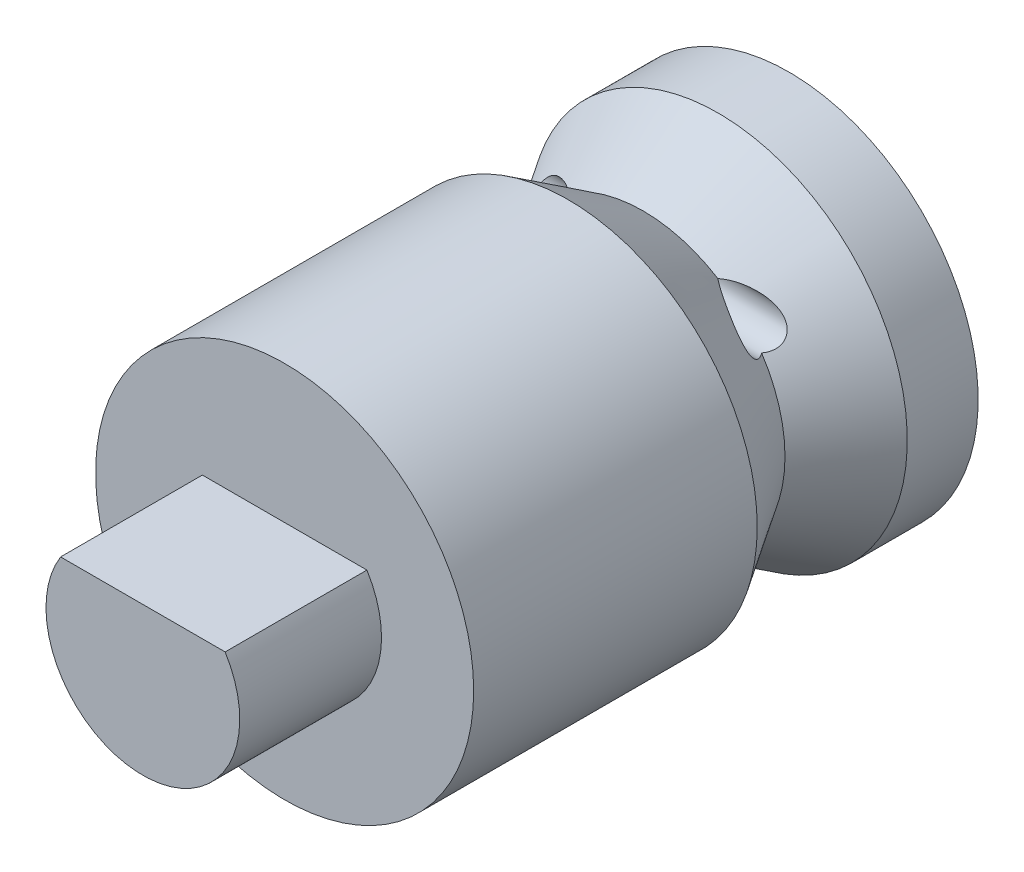
ISO-10303-21;
HEADER;
FILE_DESCRIPTION(('STEP AP214'),'2;1');
FILE_NAME('part.step','',(''),(''),'','','');
FILE_SCHEMA(('AUTOMOTIVE_DESIGN { 1 0 10303 214 1 1 1 1 }'));
ENDSEC;
DATA;
#1=APPLICATION_CONTEXT('core data for automotive mechanical design processes');
#2=APPLICATION_PROTOCOL_DEFINITION('international standard','automotive_design',2000,#1);
#3=PRODUCT_CONTEXT('',#1,'mechanical');
#4=PRODUCT('Part','Part','',(#3));
#5=PRODUCT_RELATED_PRODUCT_CATEGORY('part','',(#4));
#6=PRODUCT_DEFINITION_FORMATION('','',#4);
#7=PRODUCT_DEFINITION_CONTEXT('part definition',#1,'design');
#8=PRODUCT_DEFINITION('design','',#6,#7);
#9=PRODUCT_DEFINITION_SHAPE('','',#8);
#10=(LENGTH_UNIT() NAMED_UNIT(*) SI_UNIT(.MILLI.,.METRE.));
#11=(NAMED_UNIT(*) PLANE_ANGLE_UNIT() SI_UNIT($,.RADIAN.));
#12=(NAMED_UNIT(*) SI_UNIT($,.STERADIAN.) SOLID_ANGLE_UNIT());
#13=UNCERTAINTY_MEASURE_WITH_UNIT(LENGTH_MEASURE(1.E-05),#10,'distance_accuracy_value','');
#14=(GEOMETRIC_REPRESENTATION_CONTEXT(3) GLOBAL_UNCERTAINTY_ASSIGNED_CONTEXT((#13)) GLOBAL_UNIT_ASSIGNED_CONTEXT((#10,
#11,#12)) REPRESENTATION_CONTEXT('',''));
#15=CARTESIAN_POINT('',(0.,0.,0.));
#16=DIRECTION('',(0.,0.,1.));
#17=DIRECTION('',(1.,0.,0.));
#18=AXIS2_PLACEMENT_3D('',#15,#16,#17);
#19=CARTESIAN_POINT('',(0.,0.,3.175));
#20=DIRECTION('',(0.,0.,1.));
#21=DIRECTION('',(1.,0.,0.));
#22=AXIS2_PLACEMENT_3D('',#19,#20,#21);
#23=CONICAL_SURFACE('',#22,4.,0.562130374114294);
#24=CARTESIAN_POINT('',(1.5294042731664,2.5477242008201,1.5423));
#25=CARTESIAN_POINT('',(1.5482327028628,2.54948389636122,1.56007104937971));
#26=CARTESIAN_POINT('',(1.56774260902939,2.55017404496586,1.5771445647045));
#27=CARTESIAN_POINT('',(1.6076717351285,2.54974300659172,1.61007269180868));
#28=CARTESIAN_POINT('',(1.62808848113938,2.54862648473213,1.62593033250121));
#29=CARTESIAN_POINT('',(1.66948462537356,2.54491504151267,1.65669652034396));
#30=CARTESIAN_POINT('',(1.69046417839127,2.54231970936469,1.67160480249886));
#31=CARTESIAN_POINT('',(1.73280469353861,2.53580803655754,1.700604889451));
#32=CARTESIAN_POINT('',(1.7541659935145,2.53189046467972,1.71469591887069));
#33=CARTESIAN_POINT('',(1.81036423147723,2.52005173155219,1.7506050678101));
#34=CARTESIAN_POINT('',(1.84538065381172,2.5111519239564,1.77182427328294));
#35=CARTESIAN_POINT('',(1.91558198795479,2.49039681362099,1.81246733728234));
#36=CARTESIAN_POINT('',(1.95076694535503,2.47854066101174,1.8318906773411));
#37=CARTESIAN_POINT('',(2.02105545291796,2.45187922425174,1.8689294369262));
#38=CARTESIAN_POINT('',(2.05615878708333,2.4370693170562,1.88654195593412));
#39=CARTESIAN_POINT('',(2.12590526372888,2.40443040151884,1.91970927100217));
#40=CARTESIAN_POINT('',(2.16054871285227,2.3866035264529,1.93526550729696));
#41=CARTESIAN_POINT('',(2.23226917336937,2.34590377859288,1.96529725300637));
#42=CARTESIAN_POINT('',(2.26926898382374,2.32271416418155,1.97953387014772));
#43=CARTESIAN_POINT('',(2.34159831263125,2.27215599528751,2.00421674554654));
#44=CARTESIAN_POINT('',(2.37693153027699,2.24479732761817,2.01467177888853));
#45=CARTESIAN_POINT('',(2.43568145913419,2.19349724754097,2.02824807823447));
#46=CARTESIAN_POINT('',(2.45974184218238,2.17062443959667,2.03258681514409));
#47=CARTESIAN_POINT('',(2.50565093121978,2.12234731474219,2.03759822473926));
#48=CARTESIAN_POINT('',(2.52750284262363,2.09694677615259,2.0382762878144));
#49=CARTESIAN_POINT('',(2.56136538881817,2.05234182881393,2.03533443273535));
#50=CARTESIAN_POINT('',(2.57428971114993,2.03375053246559,2.03301845750295));
#51=CARTESIAN_POINT('',(2.59802867561556,1.99576187201482,2.02568623493127));
#52=CARTESIAN_POINT('',(2.60884649008711,1.97636577420739,2.02067409145141));
#53=CARTESIAN_POINT('',(2.62603642700682,1.94080820121208,2.00873996936309));
#54=CARTESIAN_POINT('',(2.63285869832089,1.92469584912998,2.00232704124862));
#55=CARTESIAN_POINT('',(2.6443150855226,1.89271175848821,1.98730358817727));
#56=CARTESIAN_POINT('',(2.64895064090329,1.87683986831506,1.97869451468883));
#57=CARTESIAN_POINT('',(2.65578966181134,1.84581020856919,1.95928455164256));
#58=CARTESIAN_POINT('',(2.65798110392673,1.83065631747151,1.9484731332519));
#59=CARTESIAN_POINT('',(2.65980663016899,1.80172228117331,1.9249579261403));
#60=CARTESIAN_POINT('',(2.65944048579718,1.78794225882789,1.91225396843622));
#61=CARTESIAN_POINT('',(2.65640851727158,1.76322042685016,1.88645443356544));
#62=CARTESIAN_POINT('',(2.65392542600317,1.75214074728038,1.87346783465128));
#63=CARTESIAN_POINT('',(2.64712767985484,1.73172803368778,1.84665240615805));
#64=CARTESIAN_POINT('',(2.64281360231087,1.72239445043148,1.83282384323843));
#65=CARTESIAN_POINT('',(2.63095391673974,1.70277063736753,1.80006194549292));
#66=CARTESIAN_POINT('',(2.62281315318754,1.69316243922514,1.78093559707063));
#67=CARTESIAN_POINT('',(2.604348252148,1.67696788407756,1.74236935820742));
#68=CARTESIAN_POINT('',(2.59401334833239,1.67039695508051,1.72292837514507));
#69=CARTESIAN_POINT('',(2.5666546418681,1.65773897636796,1.67553391082162));
#70=CARTESIAN_POINT('',(2.54871802755129,1.65321094688141,1.6477016046787));
#71=CARTESIAN_POINT('',(2.51066220222931,1.64924017701346,1.59367743604431));
#72=CARTESIAN_POINT('',(2.49057305589504,1.64973461654627,1.56746942412563));
#73=CARTESIAN_POINT('',(2.46980985455733,1.6522757991799,1.5423));
#74=B_SPLINE_CURVE_WITH_KNOTS('',3,(#24,#25,#26,#27,#28,#29,#30,#31,#32,#33,#34,#35,#36,#37,#38,
#39,#40,#41,#42,#43,#44,#45,#46,#47,#48,#49,#50,#51,#52,#53,#54,#55,#56,#57,#58,#59,#60,#61,#62,
#63,#64,#65,#66,#67,#68,#69,#70,#71,#72,#73),.UNSPECIFIED.,.F.,.F.,(4,2,2,2,2,2,2,2,2,2,2,2,2,2,
2,2,2,2,2,2,2,2,2,2,4),(0.,0.0777301791109106,0.155259966258429,0.232811300356197,
0.310435047410511,0.435970547304753,0.561542176967004,0.687311908549589,0.812993078025049,
0.950483539888179,1.08765287963951,1.18782497564422,1.28784952662814,1.35591740426615,
1.42388196719556,1.47956014128183,1.5352016116621,1.59111561007949,1.64703460400294,
1.69856510155684,1.75007936287099,1.81840697152291,1.88707794050627,1.98676508661568,
2.08520691576281),.UNSPECIFIED.);
#75=CARTESIAN_POINT('',(1.58034806292791,2.55,1.5875));
#76=VERTEX_POINT('',#75);
#77=CARTESIAN_POINT('',(2.50549396327351,1.65,1.5875));
#78=VERTEX_POINT('',#77);
#79=EDGE_CURVE('E168',#76,#78,#74,.T.);
#80=ORIENTED_EDGE('',*,*,#79,.F.);
#81=CARTESIAN_POINT('',(0.,0.,1.5875));
#82=DIRECTION('',(0.,0.,1.));
#83=DIRECTION('',(1.,0.,0.));
#84=AXIS2_PLACEMENT_3D('',#81,#82,#83);
#85=CIRCLE('',#84,3.);
#86=CARTESIAN_POINT('',(-1.58034806292791,2.55,1.5875));
#87=VERTEX_POINT('',#86);
#88=EDGE_CURVE('E225',#76,#87,#85,.T.);
#89=ORIENTED_EDGE('',*,*,#88,.T.);
#90=CARTESIAN_POINT('',(-2.46980985455733,1.6522757991799,1.5423));
#91=CARTESIAN_POINT('',(-2.48939971948312,1.64988068173497,1.56604598260973));
#92=CARTESIAN_POINT('',(-2.50837183059614,1.64930398050784,1.59069402971352));
#93=CARTESIAN_POINT('',(-2.54445665433033,1.65251026340648,1.64142397028666));
#94=CARTESIAN_POINT('',(-2.56154704534297,1.65634045179825,1.66751848514836));
#95=CARTESIAN_POINT('',(-2.58851577079974,1.66741352066019,1.71302572029721));
#96=CARTESIAN_POINT('',(-2.59908854977143,1.67343741817217,1.73231521613376));
#97=CARTESIAN_POINT('',(-2.6181650222865,1.68846216488843,1.77069043121218));
#98=CARTESIAN_POINT('',(-2.62667676584128,1.69745109702788,1.78977665548794));
#99=CARTESIAN_POINT('',(-2.63984133549446,1.71671843083465,1.82395376070816));
#100=CARTESIAN_POINT('',(-2.64490765369921,1.72650158248051,1.83916273456955));
#101=CARTESIAN_POINT('',(-2.65291188279003,1.74815891613375,1.86864361663681));
#102=CARTESIAN_POINT('',(-2.65584998983761,1.76003290529898,1.88291561109566));
#103=CARTESIAN_POINT('',(-2.65930718937489,1.78570349867304,1.9100966481421));
#104=CARTESIAN_POINT('',(-2.6598140623378,1.79950945667692,1.92299848780116));
#105=CARTESIAN_POINT('',(-2.65822817215552,1.82854430439762,1.94689538894704));
#106=CARTESIAN_POINT('',(-2.65613627060794,1.84377272096486,1.95789108102095));
#107=CARTESIAN_POINT('',(-2.6497200508034,1.87372242557535,1.97684008810506));
#108=CARTESIAN_POINT('',(-2.64560191603282,1.88837573375963,1.98497315386005));
#109=CARTESIAN_POINT('',(-2.63546212188981,1.91793774379913,1.99935429676595));
#110=CARTESIAN_POINT('',(-2.62943982391386,1.93284652974567,2.0056017401555));
#111=CARTESIAN_POINT('',(-2.6133357743972,1.9678183135807,2.01817952602119));
#112=CARTESIAN_POINT('',(-2.60257167009887,1.98783750030857,2.02375623561325));
#113=CARTESIAN_POINT('',(-2.57873746888574,2.02708469100757,2.03200832583257));
#114=CARTESIAN_POINT('',(-2.56566244734067,2.04631089498891,2.03467742145891));
#115=CARTESIAN_POINT('',(-2.53122870867591,2.09246836460945,2.03828178735752));
#116=CARTESIAN_POINT('',(-2.50887102712956,2.11875819006848,2.03780612268004));
#117=CARTESIAN_POINT('',(-2.46178251320152,2.16866068427222,2.03293822850327));
#118=CARTESIAN_POINT('',(-2.43704780437822,2.19226883815192,2.02853950116711));
#119=CARTESIAN_POINT('',(-2.36980782257013,2.25107438365691,2.01306469182319));
#120=CARTESIAN_POINT('',(-2.32599256338835,2.2841106413583,1.99952211293911));
#121=CARTESIAN_POINT('',(-2.23609639601212,2.34405853509097,1.96710352759137));
#122=CARTESIAN_POINT('',(-2.19000679010812,2.37094401705892,1.94820548365927));
#123=CARTESIAN_POINT('',(-2.10900914773766,2.41274582506358,1.91190628760851));
#124=CARTESIAN_POINT('',(-2.07434373132548,2.42895115982058,1.89541563733818));
#125=CARTESIAN_POINT('',(-2.00470541452356,2.45844283301489,1.86052282717738));
#126=CARTESIAN_POINT('',(-1.96973234236994,2.47172741694936,1.84211952807461));
#127=CARTESIAN_POINT('',(-1.8999402285745,2.49535098023198,1.80361473036742));
#128=CARTESIAN_POINT('',(-1.86512115966047,2.50570215188982,1.78352072487481));
#129=CARTESIAN_POINT('',(-1.79581992678575,2.52343223386955,1.7415309432175));
#130=CARTESIAN_POINT('',(-1.76133759468869,2.53081271024079,1.71963612373172));
#131=CARTESIAN_POINT('',(-1.71003279608591,2.53944548749873,1.6851208846537));
#132=CARTESIAN_POINT('',(-1.69289963986917,2.54192412186664,1.67326079562778));
#133=CARTESIAN_POINT('',(-1.65895589519434,2.54595349364876,1.64895788975511));
#134=CARTESIAN_POINT('',(-1.64214507940671,2.54750491016811,1.63651550660742));
#135=CARTESIAN_POINT('',(-1.60893793268075,2.54957404624986,1.61093689502562));
#136=CARTESIAN_POINT('',(-1.59254235885664,2.55008999544019,1.59779951761857));
#137=CARTESIAN_POINT('',(-1.56040888309007,2.54988650408579,1.57069768996814));
#138=CARTESIAN_POINT('',(-1.54467231201438,2.54916467647918,1.55673169188393));
#139=CARTESIAN_POINT('',(-1.52940427316639,2.54772420082013,1.54230000000002));
#140=B_SPLINE_CURVE_WITH_KNOTS('',3,(#90,#91,#92,#93,#94,#95,#96,#97,#98,#99,#100,#101,#102,
#103,#104,#105,#106,#107,#108,#109,#110,#111,#112,#113,#114,#115,#116,#117,#118,#119,#120,#121,
#122,#123,#124,#125,#126,#127,#128,#129,#130,#131,#132,#133,#134,#135,#136,#137,#138,#139),
.UNSPECIFIED.,.F.,.F.,(4,2,2,2,2,2,2,2,2,2,2,2,2,2,2,2,2,2,2,2,2,2,2,2,4),(0.,
0.0928184774844339,0.186640506902951,0.254817459360389,0.322723667620977,0.378833676568371,
0.434938513084978,0.491325042447452,0.547692882410072,0.599240846939503,0.650806117596179,
0.720626379681879,0.790597265263628,0.893560470965525,0.996694533784482,1.16532378412603,
1.3346572703877,1.45951574839795,1.58444902554042,1.70885515323434,1.83319561209082,
1.89612436366338,1.95900696882405,2.02199699513249,2.08510863484253),.UNSPECIFIED.);
#141=CARTESIAN_POINT('',(-2.5054939632693,1.64999999999309,1.58750000001362));
#142=VERTEX_POINT('',#141);
#143=EDGE_CURVE('E75',#142,#87,#140,.T.);
#144=ORIENTED_EDGE('',*,*,#143,.F.);
#145=EDGE_CURVE('E220',#142,#78,#85,.T.);
#146=ORIENTED_EDGE('',*,*,#145,.T.);
#147=EDGE_LOOP('',(#80,#89,#144,#146));
#148=FACE_BOUND('',#147,.T.);
#149=CARTESIAN_POINT('',(0.,0.,3.175));
#150=DIRECTION('',(0.,0.,1.));
#151=DIRECTION('',(1.,0.,0.));
#152=AXIS2_PLACEMENT_3D('',#149,#150,#151);
#153=CIRCLE('',#152,4.);
#154=CARTESIAN_POINT('',(4.,0.,3.175));
#155=VERTEX_POINT('',#154);
#156=EDGE_CURVE('E218',#155,#155,#153,.T.);
#157=ORIENTED_EDGE('',*,*,#156,.F.);
#158=EDGE_LOOP('',(#157));
#159=FACE_BOUND('',#158,.T.);
#160=ADVANCED_FACE('F47',(#148,#159),#23,.T.);
#161=CARTESIAN_POINT('',(0.,0.,1.5875));
#162=DIRECTION('',(0.,0.,-1.));
#163=DIRECTION('',(-1.,0.,0.));
#164=AXIS2_PLACEMENT_3D('',#161,#162,#163);
#165=CONICAL_SURFACE('',#164,3.,0.562130374114294);
#166=CARTESIAN_POINT('',(2.46980985455733,1.6522757991799,1.6327));
#167=CARTESIAN_POINT('',(2.48939971948312,1.64988068173497,1.60895401739027));
#168=CARTESIAN_POINT('',(2.50837183059614,1.64930398050784,1.58430597028648));
#169=CARTESIAN_POINT('',(2.54445665433033,1.65251026340648,1.53357602971334));
#170=CARTESIAN_POINT('',(2.56154704534297,1.65634045179825,1.50748151485164));
#171=CARTESIAN_POINT('',(2.58851577079974,1.66741352066019,1.46197427970279));
#172=CARTESIAN_POINT('',(2.59908854977143,1.67343741817217,1.44268478386624));
#173=CARTESIAN_POINT('',(2.6181650222865,1.68846216488843,1.40430956878782));
#174=CARTESIAN_POINT('',(2.62667676584128,1.69745109702788,1.38522334451206));
#175=CARTESIAN_POINT('',(2.63984133549446,1.71671843083465,1.35104623929184));
#176=CARTESIAN_POINT('',(2.64490765369921,1.72650158248051,1.33583726543045));
#177=CARTESIAN_POINT('',(2.65291188279003,1.74815891613375,1.30635638336319));
#178=CARTESIAN_POINT('',(2.65584998983761,1.76003290529898,1.29208438890434));
#179=CARTESIAN_POINT('',(2.65930718937489,1.78570349867304,1.2649033518579));
#180=CARTESIAN_POINT('',(2.6598140623378,1.79950945667692,1.25200151219884));
#181=CARTESIAN_POINT('',(2.65822817215552,1.82854430439762,1.22810461105296));
#182=CARTESIAN_POINT('',(2.65613627060794,1.84377272096486,1.21710891897905));
#183=CARTESIAN_POINT('',(2.6497200508034,1.87372242557535,1.19815991189494));
#184=CARTESIAN_POINT('',(2.64560191603282,1.88837573375963,1.19002684613995));
#185=CARTESIAN_POINT('',(2.63546212188981,1.91793774379913,1.17564570323405));
#186=CARTESIAN_POINT('',(2.62943982391386,1.93284652974567,1.1693982598445));
#187=CARTESIAN_POINT('',(2.6133357743972,1.9678183135807,1.15682047397881));
#188=CARTESIAN_POINT('',(2.60257167009887,1.98783750030857,1.15124376438675));
#189=CARTESIAN_POINT('',(2.57873746888574,2.02708469100757,1.14299167416743));
#190=CARTESIAN_POINT('',(2.56566244734068,2.04631089498891,1.14032257854109));
#191=CARTESIAN_POINT('',(2.53122870867591,2.09246836460945,1.13671821264248));
#192=CARTESIAN_POINT('',(2.50887102712956,2.11875819006848,1.13719387731996));
#193=CARTESIAN_POINT('',(2.46178251320152,2.16866068427222,1.14206177149673));
#194=CARTESIAN_POINT('',(2.43704780437822,2.19226883815192,1.14646049883289));
#195=CARTESIAN_POINT('',(2.36980782257013,2.25107438365691,1.16193530817681));
#196=CARTESIAN_POINT('',(2.32599256338835,2.2841106413583,1.17547788706089));
#197=CARTESIAN_POINT('',(2.23609639601213,2.34405853509097,1.20789647240863));
#198=CARTESIAN_POINT('',(2.19000679010812,2.37094401705892,1.22679451634073));
#199=CARTESIAN_POINT('',(2.10900914773766,2.41274582506357,1.26309371239149));
#200=CARTESIAN_POINT('',(2.07434373132549,2.42895115982058,1.27958436266182));
#201=CARTESIAN_POINT('',(2.00470541452357,2.45844283301489,1.31447717282262));
#202=CARTESIAN_POINT('',(1.96973234236994,2.47172741694936,1.33288047192539));
#203=CARTESIAN_POINT('',(1.8999402285745,2.49535098023198,1.37138526963257));
#204=CARTESIAN_POINT('',(1.86512115966047,2.50570215188982,1.39147927512518));
#205=CARTESIAN_POINT('',(1.79581992678575,2.52343223386955,1.4334690567825));
#206=CARTESIAN_POINT('',(1.7613375946887,2.53081271024079,1.45536387626828));
#207=CARTESIAN_POINT('',(1.71003279608592,2.53944548749873,1.4898791153463));
#208=CARTESIAN_POINT('',(1.69289963986918,2.54192412186664,1.50173920437222));
#209=CARTESIAN_POINT('',(1.65895589519434,2.54595349364876,1.52604211024489));
#210=CARTESIAN_POINT('',(1.64214507940671,2.54750491016811,1.53848449339258));
#211=CARTESIAN_POINT('',(1.60893793268075,2.54957404624986,1.56406310497438));
#212=CARTESIAN_POINT('',(1.59254235885664,2.55008999544019,1.57720048238143));
#213=CARTESIAN_POINT('',(1.56040888309007,2.54988650408579,1.60430231003186));
#214=CARTESIAN_POINT('',(1.54467231201438,2.54916467647918,1.61826830811607));
#215=CARTESIAN_POINT('',(1.52940427316639,2.54772420082013,1.63269999999998));
#216=B_SPLINE_CURVE_WITH_KNOTS('',3,(#166,#167,#168,#169,#170,#171,#172,#173,#174,#175,#176,
#177,#178,#179,#180,#181,#182,#183,#184,#185,#186,#187,#188,#189,#190,#191,#192,#193,#194,#195,
#196,#197,#198,#199,#200,#201,#202,#203,#204,#205,#206,#207,#208,#209,#210,#211,#212,#213,#214,
#215),.UNSPECIFIED.,.F.,.F.,(4,2,2,2,2,2,2,2,2,2,2,2,2,2,2,2,2,2,2,2,2,2,2,2,4),(0.,
0.0928184774844339,0.186640506902951,0.254817459360389,0.322723667620978,0.378833676568371,
0.434938513084979,0.491325042447452,0.547692882410073,0.599240846939503,0.650806117596179,
0.720626379681879,0.790597265263627,0.893560470965524,0.996694533784481,1.16532378412603,
1.3346572703877,1.45951574839795,1.58444902554042,1.70885515323434,1.83319561209082,
1.89612436366338,1.95900696882405,2.02199699513249,2.08510863484253),.UNSPECIFIED.);
#217=EDGE_CURVE('E11',#78,#76,#216,.T.);
#218=ORIENTED_EDGE('',*,*,#217,.F.);
#219=ORIENTED_EDGE('',*,*,#145,.F.);
#220=CARTESIAN_POINT('',(-1.5294042731664,2.5477242008201,1.6327));
#221=CARTESIAN_POINT('',(-1.5482327028628,2.54948389636122,1.61492895062029));
#222=CARTESIAN_POINT('',(-1.56774260902939,2.55017404496586,1.5978554352955));
#223=CARTESIAN_POINT('',(-1.6076717351285,2.54974300659172,1.56492730819132));
#224=CARTESIAN_POINT('',(-1.62808848113938,2.54862648473213,1.54906966749879));
#225=CARTESIAN_POINT('',(-1.66948462537356,2.54491504151267,1.51830347965604));
#226=CARTESIAN_POINT('',(-1.69046417839127,2.54231970936469,1.50339519750114));
#227=CARTESIAN_POINT('',(-1.73280469353861,2.53580803655754,1.474395110549));
#228=CARTESIAN_POINT('',(-1.7541659935145,2.53189046467972,1.46030408112931));
#229=CARTESIAN_POINT('',(-1.81036423147723,2.52005173155219,1.4243949321899));
#230=CARTESIAN_POINT('',(-1.84538065381172,2.5111519239564,1.40317572671706));
#231=CARTESIAN_POINT('',(-1.91558198795479,2.49039681362099,1.36253266271766));
#232=CARTESIAN_POINT('',(-1.95076694535503,2.47854066101174,1.3431093226589));
#233=CARTESIAN_POINT('',(-2.02105545291796,2.45187922425174,1.3060705630738));
#234=CARTESIAN_POINT('',(-2.05615878708333,2.4370693170562,1.28845804406588));
#235=CARTESIAN_POINT('',(-2.12590526372888,2.40443040151884,1.25529072899783));
#236=CARTESIAN_POINT('',(-2.16054871285227,2.3866035264529,1.23973449270304));
#237=CARTESIAN_POINT('',(-2.23226917336937,2.34590377859288,1.20970274699363));
#238=CARTESIAN_POINT('',(-2.26926898382374,2.32271416418155,1.19546612985228));
#239=CARTESIAN_POINT('',(-2.34159831263125,2.27215599528751,1.17078325445346));
#240=CARTESIAN_POINT('',(-2.37693153027698,2.24479732761817,1.16032822111147));
#241=CARTESIAN_POINT('',(-2.43568145913419,2.19349724754097,1.14675192176553));
#242=CARTESIAN_POINT('',(-2.45974184218238,2.17062443959667,1.14241318485591));
#243=CARTESIAN_POINT('',(-2.50565093121978,2.12234731474219,1.13740177526074));
#244=CARTESIAN_POINT('',(-2.52750284262363,2.09694677615259,1.1367237121856));
#245=CARTESIAN_POINT('',(-2.56136538881817,2.05234182881394,1.13966556726464));
#246=CARTESIAN_POINT('',(-2.57428971114993,2.03375053246559,1.14198154249705));
#247=CARTESIAN_POINT('',(-2.59802867561556,1.99576187201482,1.14931376506873));
#248=CARTESIAN_POINT('',(-2.60884649008711,1.97636577420739,1.15432590854859));
#249=CARTESIAN_POINT('',(-2.62603642700682,1.94080820121208,1.16626003063691));
#250=CARTESIAN_POINT('',(-2.63285869832089,1.92469584912998,1.17267295875138));
#251=CARTESIAN_POINT('',(-2.6443150855226,1.89271175848821,1.18769641182273));
#252=CARTESIAN_POINT('',(-2.64895064090329,1.87683986831506,1.19630548531117));
#253=CARTESIAN_POINT('',(-2.65578966181134,1.84581020856919,1.21571544835744));
#254=CARTESIAN_POINT('',(-2.65798110392673,1.83065631747151,1.2265268667481));
#255=CARTESIAN_POINT('',(-2.65980663016899,1.80172228117331,1.2500420738597));
#256=CARTESIAN_POINT('',(-2.65944048579718,1.78794225882788,1.26274603156378));
#257=CARTESIAN_POINT('',(-2.65640851727158,1.76322042685016,1.28854556643456));
#258=CARTESIAN_POINT('',(-2.65392542600317,1.75214074728038,1.30153216534872));
#259=CARTESIAN_POINT('',(-2.64712767985484,1.73172803368778,1.32834759384195));
#260=CARTESIAN_POINT('',(-2.64281360231087,1.72239445043148,1.34217615676157));
#261=CARTESIAN_POINT('',(-2.63095391673974,1.70277063736753,1.37493805450708));
#262=CARTESIAN_POINT('',(-2.62281315318754,1.69316243922514,1.39406440292937));
#263=CARTESIAN_POINT('',(-2.604348252148,1.67696788407756,1.43263064179258));
#264=CARTESIAN_POINT('',(-2.59401334833239,1.67039695508051,1.45207162485493));
#265=CARTESIAN_POINT('',(-2.5666546418681,1.65773897636796,1.49946608917839));
#266=CARTESIAN_POINT('',(-2.54871802755129,1.65321094688141,1.5272983953213));
#267=CARTESIAN_POINT('',(-2.51066220222931,1.64924017701346,1.58132256395569));
#268=CARTESIAN_POINT('',(-2.49057305589504,1.64973461654627,1.60753057587437));
#269=CARTESIAN_POINT('',(-2.46980985455733,1.6522757991799,1.6327));
#270=B_SPLINE_CURVE_WITH_KNOTS('',3,(#220,#221,#222,#223,#224,#225,#226,#227,#228,#229,#230,
#231,#232,#233,#234,#235,#236,#237,#238,#239,#240,#241,#242,#243,#244,#245,#246,#247,#248,#249,
#250,#251,#252,#253,#254,#255,#256,#257,#258,#259,#260,#261,#262,#263,#264,#265,#266,#267,#268,
#269),.UNSPECIFIED.,.F.,.F.,(4,2,2,2,2,2,2,2,2,2,2,2,2,2,2,2,2,2,2,2,2,2,2,2,4),(0.,
0.0777301791109104,0.155259966258429,0.232811300356197,0.310435047410511,0.435970547304753,
0.561542176967003,0.687311908549589,0.812993078025047,0.950483539888178,1.08765287963951,
1.18782497564422,1.28784952662814,1.35591740426615,1.42388196719556,1.47956014128183,
1.5352016116621,1.59111561007949,1.64703460400294,1.69856510155684,1.75007936287099,
1.81840697152291,1.88707794050627,1.98676508661569,2.08520691576281),.UNSPECIFIED.);
#271=EDGE_CURVE('E62',#87,#142,#270,.T.);
#272=ORIENTED_EDGE('',*,*,#271,.F.);
#273=ORIENTED_EDGE('',*,*,#88,.F.);
#274=EDGE_LOOP('',(#218,#219,#272,#273));
#275=FACE_BOUND('',#274,.T.);
#276=CARTESIAN_POINT('',(0.,0.,0.));
#277=DIRECTION('',(0.,0.,-1.));
#278=DIRECTION('',(-1.,0.,0.));
#279=AXIS2_PLACEMENT_3D('',#276,#277,#278);
#280=CIRCLE('',#279,4.);
#281=CARTESIAN_POINT('',(-4.,0.,0.));
#282=VERTEX_POINT('',#281);
#283=EDGE_CURVE('E148',#282,#282,#280,.T.);
#284=ORIENTED_EDGE('',*,*,#283,.F.);
#285=EDGE_LOOP('',(#284));
#286=FACE_BOUND('',#285,.T.);
#287=ADVANCED_FACE('F194',(#275,#286),#165,.T.);
#288=CARTESIAN_POINT('',(0.,0.,9.175));
#289=DIRECTION('',(0.,0.,-1.));
#290=DIRECTION('',(-1.,0.,0.));
#291=AXIS2_PLACEMENT_3D('',#288,#289,#290);
#292=CYLINDRICAL_SURFACE('',#291,4.);
#293=CARTESIAN_POINT('',(0.,0.,9.175));
#294=DIRECTION('',(0.,0.,1.));
#295=DIRECTION('',(1.,0.,0.));
#296=AXIS2_PLACEMENT_3D('',#293,#294,#295);
#297=CIRCLE('',#296,4.);
#298=CARTESIAN_POINT('',(4.,0.,9.175));
#299=VERTEX_POINT('',#298);
#300=EDGE_CURVE('E221',#299,#299,#297,.T.);
#301=ORIENTED_EDGE('',*,*,#300,.F.);
#302=EDGE_LOOP('',(#301));
#303=FACE_BOUND('',#302,.T.);
#304=ORIENTED_EDGE('',*,*,#156,.T.);
#305=EDGE_LOOP('',(#304));
#306=FACE_BOUND('',#305,.T.);
#307=ADVANCED_FACE('F197',(#303,#306),#292,.T.);
#308=CARTESIAN_POINT('',(0.,0.,9.175));
#309=DIRECTION('',(0.,0.,1.));
#310=DIRECTION('',(1.,0.,0.));
#311=AXIS2_PLACEMENT_3D('',#308,#309,#310);
#312=PLANE('',#311);
#313=CARTESIAN_POINT('',(0.,0.,9.175));
#314=DIRECTION('',(0.,0.,1.));
#315=DIRECTION('',(1.,0.,0.));
#316=AXIS2_PLACEMENT_3D('',#313,#314,#315);
#317=CIRCLE('',#316,2.05);
#318=CARTESIAN_POINT('',(-1.74086903585537,1.08253175473055,9.175));
#319=VERTEX_POINT('',#318);
#320=CARTESIAN_POINT('',(1.74086903585537,1.08253175473055,9.175));
#321=VERTEX_POINT('',#320);
#322=EDGE_CURVE('E126',#319,#321,#317,.T.);
#323=ORIENTED_EDGE('',*,*,#322,.F.);
#324=DIRECTION('',(-1.,0.,0.));
#325=VECTOR('',#324,1.);
#326=CARTESIAN_POINT('',(1.74086903585537,1.08253175473055,9.175));
#327=LINE('',#326,#325);
#328=EDGE_CURVE('E68',#321,#319,#327,.T.);
#329=ORIENTED_EDGE('',*,*,#328,.F.);
#330=EDGE_LOOP('',(#323,#329));
#331=FACE_BOUND('',#330,.T.);
#332=ORIENTED_EDGE('',*,*,#300,.T.);
#333=EDGE_LOOP('',(#332));
#334=FACE_BOUND('',#333,.T.);
#335=ADVANCED_FACE('F181',(#331,#334),#312,.T.);
#336=CARTESIAN_POINT('',(-4.,2.1,1.5875));
#337=DIRECTION('',(1.,0.,0.));
#338=DIRECTION('',(0.,0.,-1.));
#339=AXIS2_PLACEMENT_3D('',#336,#337,#338);
#340=CYLINDRICAL_SURFACE('',#339,0.45);
#341=ORIENTED_EDGE('',*,*,#79,.T.);
#342=ORIENTED_EDGE('',*,*,#217,.T.);
#343=EDGE_LOOP('',(#341,#342));
#344=FACE_BOUND('',#343,.T.);
#345=ORIENTED_EDGE('',*,*,#143,.T.);
#346=ORIENTED_EDGE('',*,*,#271,.T.);
#347=EDGE_LOOP('',(#345,#346));
#348=FACE_BOUND('',#347,.T.);
#349=ADVANCED_FACE('F175',(#344,#348),#340,.F.);
#350=CARTESIAN_POINT('',(0.,0.,-1.5));
#351=DIRECTION('',(0.,0.,1.));
#352=DIRECTION('',(1.,0.,0.));
#353=AXIS2_PLACEMENT_3D('',#350,#351,#352);
#354=CYLINDRICAL_SURFACE('',#353,4.);
#355=CARTESIAN_POINT('',(0.,0.,-1.5));
#356=DIRECTION('',(0.,0.,-1.));
#357=DIRECTION('',(-1.,0.,0.));
#358=AXIS2_PLACEMENT_3D('',#355,#356,#357);
#359=CIRCLE('',#358,4.);
#360=CARTESIAN_POINT('',(-4.,0.,-1.5));
#361=VERTEX_POINT('',#360);
#362=EDGE_CURVE('E149',#361,#361,#359,.T.);
#363=ORIENTED_EDGE('',*,*,#362,.F.);
#364=EDGE_LOOP('',(#363));
#365=FACE_BOUND('',#364,.T.);
#366=ORIENTED_EDGE('',*,*,#283,.T.);
#367=EDGE_LOOP('',(#366));
#368=FACE_BOUND('',#367,.T.);
#369=ADVANCED_FACE('F180',(#365,#368),#354,.T.);
#370=CARTESIAN_POINT('',(0.,0.,-1.5));
#371=DIRECTION('',(0.,0.,-1.));
#372=DIRECTION('',(-1.,0.,0.));
#373=AXIS2_PLACEMENT_3D('',#370,#371,#372);
#374=PLANE('',#373);
#375=ORIENTED_EDGE('',*,*,#362,.T.);
#376=EDGE_LOOP('',(#375));
#377=FACE_BOUND('',#376,.T.);
#378=CARTESIAN_POINT('',(0.,0.,-1.5));
#379=DIRECTION('',(0.,0.,-1.));
#380=DIRECTION('',(-1.,0.,0.));
#381=AXIS2_PLACEMENT_3D('',#378,#379,#380);
#382=CIRCLE('',#381,1.75);
#383=CARTESIAN_POINT('',(-1.375,1.08253175473055,-1.5));
#384=VERTEX_POINT('',#383);
#385=CARTESIAN_POINT('',(1.375,1.08253175473055,-1.5));
#386=VERTEX_POINT('',#385);
#387=EDGE_CURVE('E111',#384,#386,#382,.F.);
#388=ORIENTED_EDGE('',*,*,#387,.T.);
#389=DIRECTION('',(-1.,0.,0.));
#390=VECTOR('',#389,1.);
#391=CARTESIAN_POINT('',(0.,1.08253175473055,-1.5));
#392=LINE('',#391,#390);
#393=EDGE_CURVE('E155',#386,#384,#392,.T.);
#394=ORIENTED_EDGE('',*,*,#393,.T.);
#395=EDGE_LOOP('',(#388,#394));
#396=FACE_BOUND('',#395,.T.);
#397=ADVANCED_FACE('F238',(#377,#396),#374,.T.);
#398=CARTESIAN_POINT('',(0.,0.,0.));
#399=DIRECTION('',(0.,0.,1.));
#400=DIRECTION('',(1.,0.,0.));
#401=AXIS2_PLACEMENT_3D('',#398,#399,#400);
#402=CYLINDRICAL_SURFACE('',#401,1.75);
#403=DIRECTION('',(0.,0.,1.));
#404=VECTOR('',#403,1.);
#405=CARTESIAN_POINT('',(-1.375,1.08253175473055,0.));
#406=LINE('',#405,#404);
#407=CARTESIAN_POINT('',(-1.375,1.08253175473055,8.175));
#408=VERTEX_POINT('',#407);
#409=EDGE_CURVE('E106',#384,#408,#406,.T.);
#410=ORIENTED_EDGE('',*,*,#409,.T.);
#411=CARTESIAN_POINT('',(0.,0.,8.175));
#412=DIRECTION('',(0.,0.,-1.));
#413=DIRECTION('',(-1.,0.,0.));
#414=AXIS2_PLACEMENT_3D('',#411,#412,#413);
#415=CIRCLE('',#414,1.75);
#416=CARTESIAN_POINT('',(1.375,1.08253175473055,8.175));
#417=VERTEX_POINT('',#416);
#418=EDGE_CURVE('E108',#417,#408,#415,.T.);
#419=ORIENTED_EDGE('',*,*,#418,.F.);
#420=DIRECTION('',(0.,0.,1.));
#421=VECTOR('',#420,1.);
#422=CARTESIAN_POINT('',(1.375,1.08253175473055,0.));
#423=LINE('',#422,#421);
#424=EDGE_CURVE('E117',#386,#417,#423,.T.);
#425=ORIENTED_EDGE('',*,*,#424,.F.);
#426=ORIENTED_EDGE('',*,*,#387,.F.);
#427=EDGE_LOOP('',(#410,#419,#425,#426));
#428=FACE_BOUND('',#427,.T.);
#429=ADVANCED_FACE('F49',(#428),#402,.F.);
#430=CARTESIAN_POINT('',(-1.375,1.08253175473055,0.));
#431=DIRECTION('',(0.,1.,0.));
#432=DIRECTION('',(0.,0.,1.));
#433=AXIS2_PLACEMENT_3D('',#430,#431,#432);
#434=PLANE('',#433);
#435=ORIENTED_EDGE('',*,*,#424,.T.);
#436=DIRECTION('',(1.,0.,0.));
#437=VECTOR('',#436,1.);
#438=CARTESIAN_POINT('',(-1.375,1.08253175473055,8.175));
#439=LINE('',#438,#437);
#440=EDGE_CURVE('E121',#408,#417,#439,.T.);
#441=ORIENTED_EDGE('',*,*,#440,.F.);
#442=ORIENTED_EDGE('',*,*,#409,.F.);
#443=ORIENTED_EDGE('',*,*,#393,.F.);
#444=EDGE_LOOP('',(#435,#441,#442,#443));
#445=FACE_BOUND('',#444,.T.);
#446=ADVANCED_FACE('F124',(#445),#434,.F.);
#447=CARTESIAN_POINT('',(0.,0.,12.175));
#448=DIRECTION('',(0.,0.,-1.));
#449=DIRECTION('',(-1.,0.,0.));
#450=AXIS2_PLACEMENT_3D('',#447,#448,#449);
#451=CYLINDRICAL_SURFACE('',#450,2.05);
#452=ORIENTED_EDGE('',*,*,#322,.T.);
#453=DIRECTION('',(0.,0.,-1.));
#454=VECTOR('',#453,1.);
#455=CARTESIAN_POINT('',(1.74086903585537,1.08253175473055,12.175));
#456=LINE('',#455,#454);
#457=CARTESIAN_POINT('',(1.74086903585537,1.08253175473055,12.175));
#458=VERTEX_POINT('',#457);
#459=EDGE_CURVE('E145',#458,#321,#456,.T.);
#460=ORIENTED_EDGE('',*,*,#459,.F.);
#461=CARTESIAN_POINT('',(0.,0.,12.175));
#462=DIRECTION('',(0.,0.,1.));
#463=DIRECTION('',(1.,0.,0.));
#464=AXIS2_PLACEMENT_3D('',#461,#462,#463);
#465=CIRCLE('',#464,2.05);
#466=CARTESIAN_POINT('',(-1.74086903585537,1.08253175473055,12.175));
#467=VERTEX_POINT('',#466);
#468=EDGE_CURVE('E132',#467,#458,#465,.T.);
#469=ORIENTED_EDGE('',*,*,#468,.F.);
#470=DIRECTION('',(0.,0.,-1.));
#471=VECTOR('',#470,1.);
#472=CARTESIAN_POINT('',(-1.74086903585537,1.08253175473055,12.175));
#473=LINE('',#472,#471);
#474=EDGE_CURVE('E138',#467,#319,#473,.T.);
#475=ORIENTED_EDGE('',*,*,#474,.T.);
#476=EDGE_LOOP('',(#452,#460,#469,#475));
#477=FACE_BOUND('',#476,.T.);
#478=ADVANCED_FACE('F250',(#477),#451,.T.);
#479=CARTESIAN_POINT('',(1.74086903585537,1.08253175473055,12.175));
#480=DIRECTION('',(0.,-1.,0.));
#481=DIRECTION('',(0.,0.,-1.));
#482=AXIS2_PLACEMENT_3D('',#479,#480,#481);
#483=PLANE('',#482);
#484=ORIENTED_EDGE('',*,*,#328,.T.);
#485=ORIENTED_EDGE('',*,*,#474,.F.);
#486=DIRECTION('',(-1.,0.,0.));
#487=VECTOR('',#486,1.);
#488=CARTESIAN_POINT('',(1.74086903585537,1.08253175473055,12.175));
#489=LINE('',#488,#487);
#490=EDGE_CURVE('E136',#458,#467,#489,.T.);
#491=ORIENTED_EDGE('',*,*,#490,.F.);
#492=ORIENTED_EDGE('',*,*,#459,.T.);
#493=EDGE_LOOP('',(#484,#485,#491,#492));
#494=FACE_BOUND('',#493,.T.);
#495=ADVANCED_FACE('F253',(#494),#483,.F.);
#496=CARTESIAN_POINT('',(0.,0.,12.175));
#497=DIRECTION('',(0.,0.,1.));
#498=DIRECTION('',(1.,0.,0.));
#499=AXIS2_PLACEMENT_3D('',#496,#497,#498);
#500=PLANE('',#499);
#501=ORIENTED_EDGE('',*,*,#468,.T.);
#502=ORIENTED_EDGE('',*,*,#490,.T.);
#503=EDGE_LOOP('',(#501,#502));
#504=FACE_BOUND('',#503,.T.);
#505=ADVANCED_FACE('F257',(#504),#500,.T.);
#506=CARTESIAN_POINT('',(0.,0.,8.175));
#507=DIRECTION('',(0.,0.,-1.));
#508=DIRECTION('',(-1.,0.,0.));
#509=AXIS2_PLACEMENT_3D('',#506,#507,#508);
#510=PLANE('',#509);
#511=ORIENTED_EDGE('',*,*,#418,.T.);
#512=ORIENTED_EDGE('',*,*,#440,.T.);
#513=EDGE_LOOP('',(#511,#512));
#514=FACE_BOUND('',#513,.T.);
#515=ADVANCED_FACE('F120',(#514),#510,.T.);
#516=CLOSED_SHELL('',(#160,#287,#307,#335,#349,#369,#397,#429,#446,#478,#495,#505,#515));
#517=MANIFOLD_SOLID_BREP('B2',#516);
#518=ADVANCED_BREP_SHAPE_REPRESENTATION('',(#18,#517),#14);
#519=SHAPE_DEFINITION_REPRESENTATION(#9,#518);
ENDSEC;
END-ISO-10303-21;
